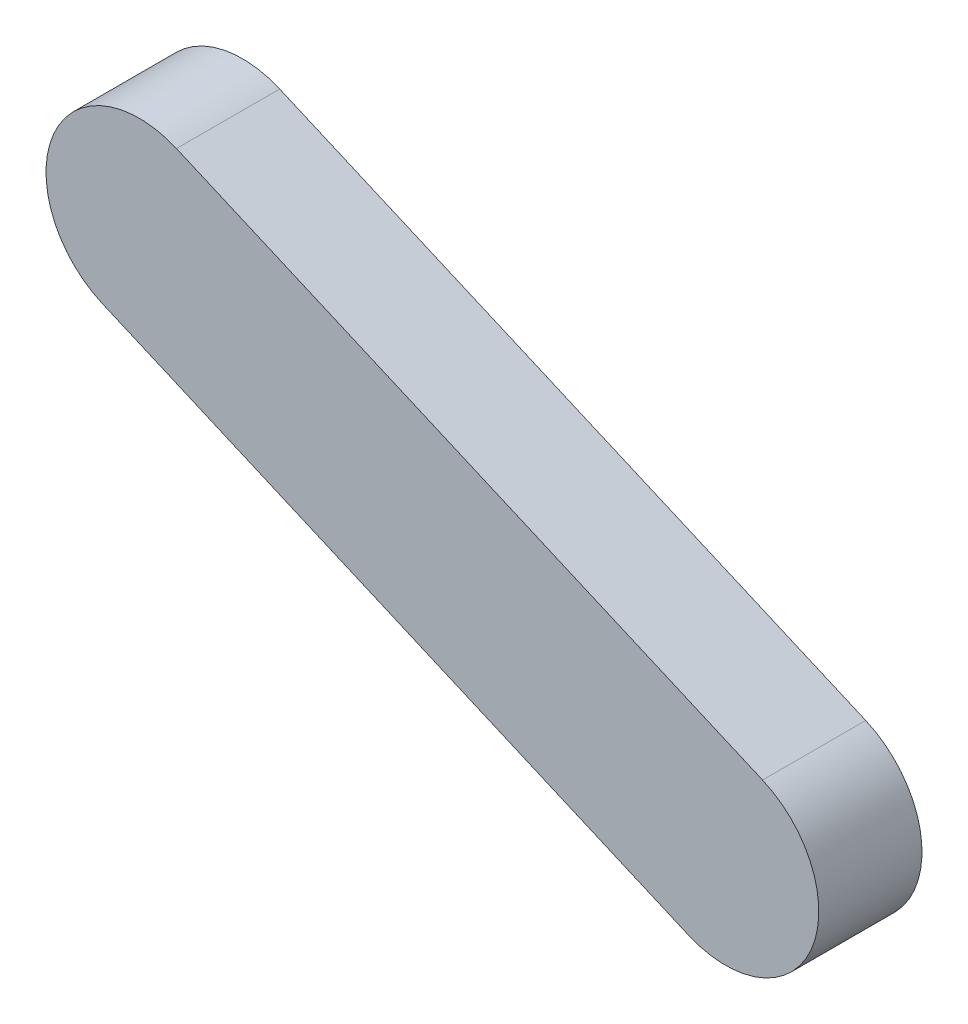
ISO-10303-21;
HEADER;
FILE_DESCRIPTION(('STEP AP214'),'2;1');
FILE_NAME('part.step','',(''),(''),'','','');
FILE_SCHEMA(('AUTOMOTIVE_DESIGN { 1 0 10303 214 1 1 1 1 }'));
ENDSEC;
DATA;
#1=APPLICATION_CONTEXT('core data for automotive mechanical design processes');
#2=APPLICATION_PROTOCOL_DEFINITION('international standard','automotive_design',2000,#1);
#3=PRODUCT_CONTEXT('',#1,'mechanical');
#4=PRODUCT('Part','Part','',(#3));
#5=PRODUCT_RELATED_PRODUCT_CATEGORY('part','',(#4));
#6=PRODUCT_DEFINITION_FORMATION('','',#4);
#7=PRODUCT_DEFINITION_CONTEXT('part definition',#1,'design');
#8=PRODUCT_DEFINITION('design','',#6,#7);
#9=PRODUCT_DEFINITION_SHAPE('','',#8);
#10=(LENGTH_UNIT() NAMED_UNIT(*) SI_UNIT(.MILLI.,.METRE.));
#11=(NAMED_UNIT(*) PLANE_ANGLE_UNIT() SI_UNIT($,.RADIAN.));
#12=(NAMED_UNIT(*) SI_UNIT($,.STERADIAN.) SOLID_ANGLE_UNIT());
#13=UNCERTAINTY_MEASURE_WITH_UNIT(LENGTH_MEASURE(1.E-05),#10,'distance_accuracy_value','');
#14=(GEOMETRIC_REPRESENTATION_CONTEXT(3) GLOBAL_UNCERTAINTY_ASSIGNED_CONTEXT((#13)) GLOBAL_UNIT_ASSIGNED_CONTEXT((#10,
#11,#12)) REPRESENTATION_CONTEXT('',''));
#15=CARTESIAN_POINT('',(0.,0.,0.));
#16=DIRECTION('',(0.,0.,1.));
#17=DIRECTION('',(1.,0.,0.));
#18=AXIS2_PLACEMENT_3D('',#15,#16,#17);
#19=CARTESIAN_POINT('',(30.5116638831863,70.4443875805027,53.34));
#20=DIRECTION('',(0.397451292096957,0.917623272596363,0.));
#21=DIRECTION('',(-0.917623272596363,0.397451292096957,0.));
#22=AXIS2_PLACEMENT_3D('',#19,#20,#21);
#23=PLANE('',#22);
#24=DIRECTION('',(0.917623272596363,-0.397451292096958,0.));
#25=VECTOR('',#24,1.);
#26=CARTESIAN_POINT('',(30.5116638831863,70.4443875805027,0.));
#27=LINE('',#26,#25);
#28=CARTESIAN_POINT('',(-1275.55706572198,636.14353629569,0.));
#29=VERTEX_POINT('',#28);
#30=CARTESIAN_POINT('',(-972.557861110664,504.905119645274,0.));
#31=VERTEX_POINT('',#30);
#32=EDGE_CURVE('E100',#29,#31,#27,.T.);
#33=ORIENTED_EDGE('',*,*,#32,.F.);
#34=DIRECTION('',(0.,0.,-1.));
#35=VECTOR('',#34,1.);
#36=CARTESIAN_POINT('',(-1275.55706572198,636.14353629569,53.34));
#37=LINE('',#36,#35);
#38=CARTESIAN_POINT('',(-1275.55706572198,636.14353629569,53.34));
#39=VERTEX_POINT('',#38);
#40=EDGE_CURVE('E11',#39,#29,#37,.T.);
#41=ORIENTED_EDGE('',*,*,#40,.F.);
#42=DIRECTION('',(0.917623272596363,-0.397451292096958,0.));
#43=VECTOR('',#42,1.);
#44=CARTESIAN_POINT('',(30.5116638831863,70.4443875805027,53.34));
#45=LINE('',#44,#43);
#46=CARTESIAN_POINT('',(-972.557861110664,504.905119645274,53.34));
#47=VERTEX_POINT('',#46);
#48=EDGE_CURVE('E85',#39,#47,#45,.T.);
#49=ORIENTED_EDGE('',*,*,#48,.T.);
#50=DIRECTION('',(0.,0.,-1.));
#51=VECTOR('',#50,1.);
#52=CARTESIAN_POINT('',(-972.557861110664,504.905119645274,53.34));
#53=LINE('',#52,#51);
#54=EDGE_CURVE('E53',#47,#31,#53,.T.);
#55=ORIENTED_EDGE('',*,*,#54,.T.);
#56=EDGE_LOOP('',(#33,#41,#49,#55));
#57=FACE_BOUND('',#56,.T.);
#58=ADVANCED_FACE('F37',(#57),#23,.T.);
#59=CARTESIAN_POINT('',(-1294.73806507858,591.859037160189,53.34));
#60=DIRECTION('',(0.,0.,-1.));
#61=DIRECTION('',(-1.,0.,0.));
#62=AXIS2_PLACEMENT_3D('',#59,#60,#61);
#63=CYLINDRICAL_SURFACE('',#62,48.26);
#64=CARTESIAN_POINT('',(-1294.73806507858,591.859037160189,0.));
#65=DIRECTION('',(0.,0.,1.));
#66=DIRECTION('',(1.,0.,0.));
#67=AXIS2_PLACEMENT_3D('',#64,#65,#66);
#68=CIRCLE('',#67,48.26);
#69=CARTESIAN_POINT('',(-1313.91906443518,547.574538024689,0.));
#70=VERTEX_POINT('',#69);
#71=EDGE_CURVE('E91',#29,#70,#68,.T.);
#72=ORIENTED_EDGE('',*,*,#71,.T.);
#73=DIRECTION('',(0.,0.,-1.));
#74=VECTOR('',#73,1.);
#75=CARTESIAN_POINT('',(-1313.91906443518,547.574538024689,53.34));
#76=LINE('',#75,#74);
#77=CARTESIAN_POINT('',(-1313.91906443518,547.574538024689,53.34));
#78=VERTEX_POINT('',#77);
#79=EDGE_CURVE('E45',#78,#70,#76,.T.);
#80=ORIENTED_EDGE('',*,*,#79,.F.);
#81=CARTESIAN_POINT('',(-1294.73806507858,591.859037160189,53.34));
#82=DIRECTION('',(0.,0.,1.));
#83=DIRECTION('',(1.,0.,0.));
#84=AXIS2_PLACEMENT_3D('',#81,#82,#83);
#85=CIRCLE('',#84,48.26);
#86=EDGE_CURVE('E79',#39,#78,#85,.T.);
#87=ORIENTED_EDGE('',*,*,#86,.F.);
#88=ORIENTED_EDGE('',*,*,#40,.T.);
#89=EDGE_LOOP('',(#72,#80,#87,#88));
#90=FACE_BOUND('',#89,.T.);
#91=ADVANCED_FACE('F89',(#90),#63,.T.);
#92=CARTESIAN_POINT('',(-7.85033483001242,-18.1246106904991,53.34));
#93=DIRECTION('',(0.397451292096958,0.917623272596363,0.));
#94=DIRECTION('',(-0.917623272596363,0.397451292096958,0.));
#95=AXIS2_PLACEMENT_3D('',#92,#93,#94);
#96=PLANE('',#95);
#97=DIRECTION('',(0.917623272596363,-0.397451292096958,0.));
#98=VECTOR('',#97,1.);
#99=CARTESIAN_POINT('',(-7.85033483001242,-18.1246106904991,0.));
#100=LINE('',#99,#98);
#101=CARTESIAN_POINT('',(-1010.91985982386,416.336121374273,0.));
#102=VERTEX_POINT('',#101);
#103=EDGE_CURVE('E103',#70,#102,#100,.T.);
#104=ORIENTED_EDGE('',*,*,#103,.T.);
#105=DIRECTION('',(0.,0.,-1.));
#106=VECTOR('',#105,1.);
#107=CARTESIAN_POINT('',(-1010.91985982386,416.336121374273,53.34));
#108=LINE('',#107,#106);
#109=CARTESIAN_POINT('',(-1010.91985982386,416.336121374273,53.34));
#110=VERTEX_POINT('',#109);
#111=EDGE_CURVE('E67',#110,#102,#108,.T.);
#112=ORIENTED_EDGE('',*,*,#111,.F.);
#113=DIRECTION('',(0.917623272596363,-0.397451292096958,0.));
#114=VECTOR('',#113,1.);
#115=CARTESIAN_POINT('',(-7.85033483001242,-18.1246106904991,53.34));
#116=LINE('',#115,#114);
#117=EDGE_CURVE('E84',#78,#110,#116,.T.);
#118=ORIENTED_EDGE('',*,*,#117,.F.);
#119=ORIENTED_EDGE('',*,*,#79,.T.);
#120=EDGE_LOOP('',(#104,#112,#118,#119));
#121=FACE_BOUND('',#120,.T.);
#122=ADVANCED_FACE('F94',(#121),#96,.F.);
#123=CARTESIAN_POINT('',(-991.738860467264,460.620620509774,53.34));
#124=DIRECTION('',(0.,0.,-1.));
#125=DIRECTION('',(-1.,0.,0.));
#126=AXIS2_PLACEMENT_3D('',#123,#124,#125);
#127=CYLINDRICAL_SURFACE('',#126,48.2600000000001);
#128=CARTESIAN_POINT('',(-991.738860467264,460.620620509774,0.));
#129=DIRECTION('',(0.,0.,1.));
#130=DIRECTION('',(1.,0.,0.));
#131=AXIS2_PLACEMENT_3D('',#128,#129,#130);
#132=CIRCLE('',#131,48.2600000000001);
#133=EDGE_CURVE('E105',#31,#102,#132,.F.);
#134=ORIENTED_EDGE('',*,*,#133,.F.);
#135=ORIENTED_EDGE('',*,*,#54,.F.);
#136=CARTESIAN_POINT('',(-991.738860467264,460.620620509774,53.34));
#137=DIRECTION('',(0.,0.,1.));
#138=DIRECTION('',(1.,0.,0.));
#139=AXIS2_PLACEMENT_3D('',#136,#137,#138);
#140=CIRCLE('',#139,48.2600000000001);
#141=EDGE_CURVE('E95',#47,#110,#140,.F.);
#142=ORIENTED_EDGE('',*,*,#141,.T.);
#143=ORIENTED_EDGE('',*,*,#111,.T.);
#144=EDGE_LOOP('',(#134,#135,#142,#143));
#145=FACE_BOUND('',#144,.T.);
#146=ADVANCED_FACE('F110',(#145),#127,.T.);
#147=CARTESIAN_POINT('',(0.,0.,53.34));
#148=DIRECTION('',(0.,0.,1.));
#149=DIRECTION('',(1.,0.,0.));
#150=AXIS2_PLACEMENT_3D('',#147,#148,#149);
#151=PLANE('',#150);
#152=ORIENTED_EDGE('',*,*,#48,.F.);
#153=ORIENTED_EDGE('',*,*,#86,.T.);
#154=ORIENTED_EDGE('',*,*,#117,.T.);
#155=ORIENTED_EDGE('',*,*,#141,.F.);
#156=EDGE_LOOP('',(#152,#153,#154,#155));
#157=FACE_BOUND('',#156,.T.);
#158=ADVANCED_FACE('F81',(#157),#151,.T.);
#159=CARTESIAN_POINT('',(0.,0.,0.));
#160=DIRECTION('',(0.,0.,1.));
#161=DIRECTION('',(1.,0.,0.));
#162=AXIS2_PLACEMENT_3D('',#159,#160,#161);
#163=PLANE('',#162);
#164=ORIENTED_EDGE('',*,*,#32,.T.);
#165=ORIENTED_EDGE('',*,*,#133,.T.);
#166=ORIENTED_EDGE('',*,*,#103,.F.);
#167=ORIENTED_EDGE('',*,*,#71,.F.);
#168=EDGE_LOOP('',(#164,#165,#166,#167));
#169=FACE_BOUND('',#168,.T.);
#170=ADVANCED_FACE('F117',(#169),#163,.F.);
#171=CLOSED_SHELL('',(#58,#91,#122,#146,#158,#170));
#172=MANIFOLD_SOLID_BREP('B2',#171);
#173=ADVANCED_BREP_SHAPE_REPRESENTATION('',(#18,#172),#14);
#174=SHAPE_DEFINITION_REPRESENTATION(#9,#173);
ENDSEC;
END-ISO-10303-21;
